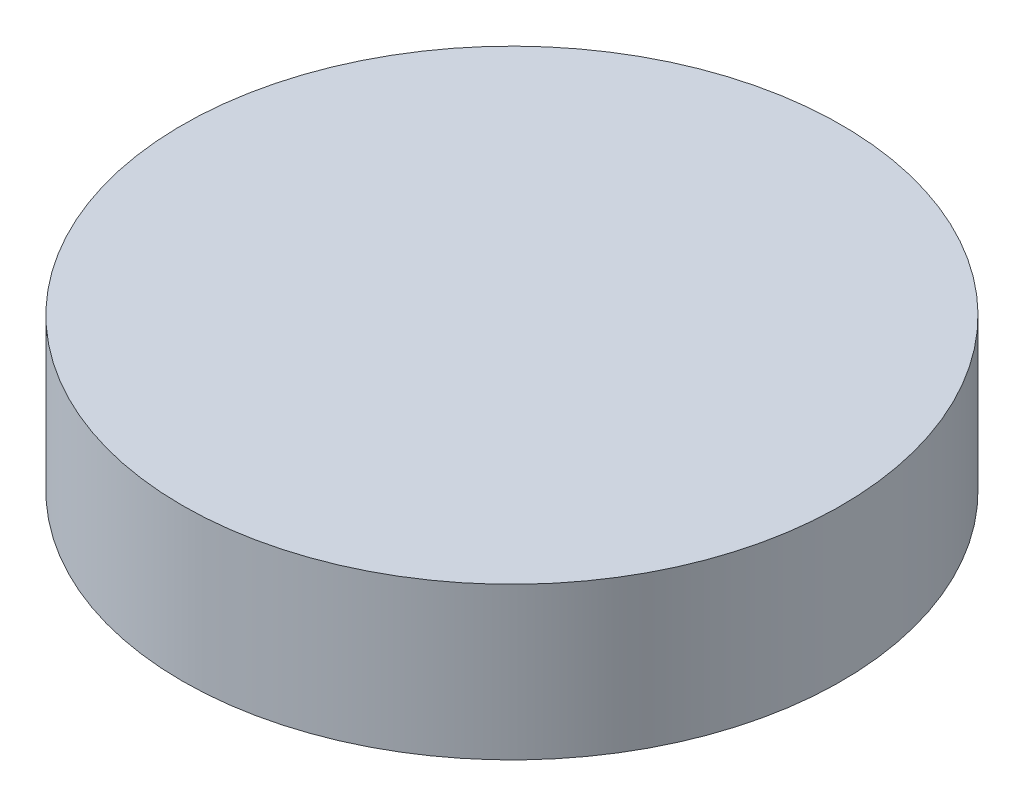
ISO-10303-21;
HEADER;
FILE_DESCRIPTION(('STEP AP214'),'2;1');
FILE_NAME('part.step','',(''),(''),'','','');
FILE_SCHEMA(('AUTOMOTIVE_DESIGN { 1 0 10303 214 1 1 1 1 }'));
ENDSEC;
DATA;
#1=APPLICATION_CONTEXT('core data for automotive mechanical design processes');
#2=APPLICATION_PROTOCOL_DEFINITION('international standard','automotive_design',2000,#1);
#3=PRODUCT_CONTEXT('',#1,'mechanical');
#4=PRODUCT('Part','Part','',(#3));
#5=PRODUCT_RELATED_PRODUCT_CATEGORY('part','',(#4));
#6=PRODUCT_DEFINITION_FORMATION('','',#4);
#7=PRODUCT_DEFINITION_CONTEXT('part definition',#1,'design');
#8=PRODUCT_DEFINITION('design','',#6,#7);
#9=PRODUCT_DEFINITION_SHAPE('','',#8);
#10=(LENGTH_UNIT() NAMED_UNIT(*) SI_UNIT(.MILLI.,.METRE.));
#11=(NAMED_UNIT(*) PLANE_ANGLE_UNIT() SI_UNIT($,.RADIAN.));
#12=(NAMED_UNIT(*) SI_UNIT($,.STERADIAN.) SOLID_ANGLE_UNIT());
#13=UNCERTAINTY_MEASURE_WITH_UNIT(LENGTH_MEASURE(1.E-05),#10,'distance_accuracy_value','');
#14=(GEOMETRIC_REPRESENTATION_CONTEXT(3) GLOBAL_UNCERTAINTY_ASSIGNED_CONTEXT((#13)) GLOBAL_UNIT_ASSIGNED_CONTEXT((#10,
#11,#12)) REPRESENTATION_CONTEXT('',''));
#15=CARTESIAN_POINT('',(0.,0.,0.));
#16=DIRECTION('',(0.,0.,1.));
#17=DIRECTION('',(1.,0.,0.));
#18=AXIS2_PLACEMENT_3D('',#15,#16,#17);
#19=CARTESIAN_POINT('',(0.,30.,0.));
#20=DIRECTION('',(0.,-1.,0.));
#21=DIRECTION('',(0.,0.,-1.));
#22=AXIS2_PLACEMENT_3D('',#19,#20,#21);
#23=CYLINDRICAL_SURFACE('',#22,65.);
#24=CARTESIAN_POINT('',(0.,30.,0.));
#25=DIRECTION('',(0.,1.,0.));
#26=DIRECTION('',(0.,0.,1.));
#27=AXIS2_PLACEMENT_3D('',#24,#25,#26);
#28=CIRCLE('',#27,65.);
#29=CARTESIAN_POINT('',(0.,30.,65.));
#30=VERTEX_POINT('',#29);
#31=EDGE_CURVE('E10',#30,#30,#28,.T.);
#32=ORIENTED_EDGE('',*,*,#31,.F.);
#33=EDGE_LOOP('',(#32));
#34=FACE_BOUND('',#33,.T.);
#35=CARTESIAN_POINT('',(0.,0.,0.));
#36=DIRECTION('',(0.,1.,0.));
#37=DIRECTION('',(0.,0.,1.));
#38=AXIS2_PLACEMENT_3D('',#35,#36,#37);
#39=CIRCLE('',#38,65.);
#40=CARTESIAN_POINT('',(0.,0.,65.));
#41=VERTEX_POINT('',#40);
#42=EDGE_CURVE('E46',#41,#41,#39,.T.);
#43=ORIENTED_EDGE('',*,*,#42,.T.);
#44=EDGE_LOOP('',(#43));
#45=FACE_BOUND('',#44,.T.);
#46=ADVANCED_FACE('F43',(#34,#45),#23,.T.);
#47=CARTESIAN_POINT('',(0.,30.,0.));
#48=DIRECTION('',(0.,1.,0.));
#49=DIRECTION('',(0.,0.,1.));
#50=AXIS2_PLACEMENT_3D('',#47,#48,#49);
#51=PLANE('',#50);
#52=ORIENTED_EDGE('',*,*,#31,.T.);
#53=EDGE_LOOP('',(#52));
#54=FACE_BOUND('',#53,.T.);
#55=ADVANCED_FACE('F60',(#54),#51,.T.);
#56=CARTESIAN_POINT('',(0.,0.,0.));
#57=DIRECTION('',(0.,1.,0.));
#58=DIRECTION('',(0.,0.,1.));
#59=AXIS2_PLACEMENT_3D('',#56,#57,#58);
#60=PLANE('',#59);
#61=ORIENTED_EDGE('',*,*,#42,.F.);
#62=EDGE_LOOP('',(#61));
#63=FACE_BOUND('',#62,.T.);
#64=ADVANCED_FACE('F58',(#63),#60,.F.);
#65=CLOSED_SHELL('',(#46,#55,#64));
#66=MANIFOLD_SOLID_BREP('B2',#65);
#67=ADVANCED_BREP_SHAPE_REPRESENTATION('',(#18,#66),#14);
#68=SHAPE_DEFINITION_REPRESENTATION(#9,#67);
ENDSEC;
END-ISO-10303-21;
